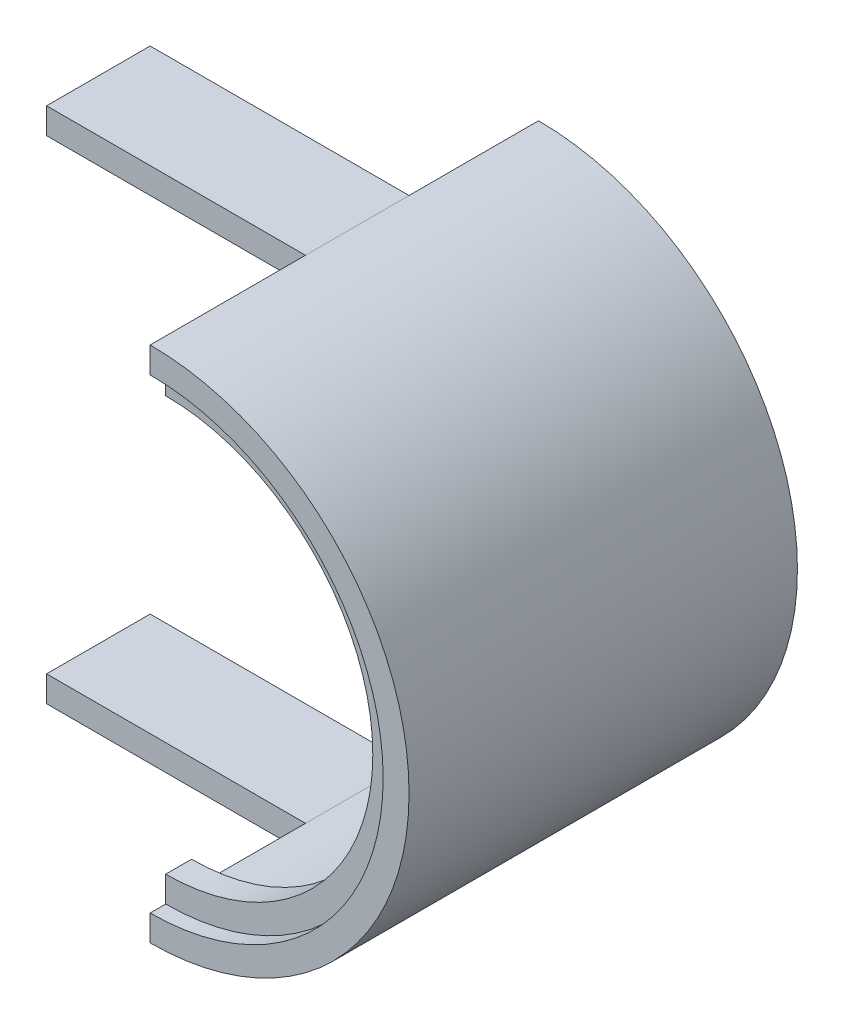
ISO-10303-21;
HEADER;
FILE_DESCRIPTION(('STEP AP214'),'2;1');
FILE_NAME('part.step','',(''),(''),'','','');
FILE_SCHEMA(('AUTOMOTIVE_DESIGN { 1 0 10303 214 1 1 1 1 }'));
ENDSEC;
DATA;
#1=APPLICATION_CONTEXT('core data for automotive mechanical design processes');
#2=APPLICATION_PROTOCOL_DEFINITION('international standard','automotive_design',2000,#1);
#3=PRODUCT_CONTEXT('',#1,'mechanical');
#4=PRODUCT('Part','Part','',(#3));
#5=PRODUCT_RELATED_PRODUCT_CATEGORY('part','',(#4));
#6=PRODUCT_DEFINITION_FORMATION('','',#4);
#7=PRODUCT_DEFINITION_CONTEXT('part definition',#1,'design');
#8=PRODUCT_DEFINITION('design','',#6,#7);
#9=PRODUCT_DEFINITION_SHAPE('','',#8);
#10=(LENGTH_UNIT() NAMED_UNIT(*) SI_UNIT(.MILLI.,.METRE.));
#11=(NAMED_UNIT(*) PLANE_ANGLE_UNIT() SI_UNIT($,.RADIAN.));
#12=(NAMED_UNIT(*) SI_UNIT($,.STERADIAN.) SOLID_ANGLE_UNIT());
#13=UNCERTAINTY_MEASURE_WITH_UNIT(LENGTH_MEASURE(1.E-05),#10,'distance_accuracy_value','');
#14=(GEOMETRIC_REPRESENTATION_CONTEXT(3) GLOBAL_UNCERTAINTY_ASSIGNED_CONTEXT((#13)) GLOBAL_UNIT_ASSIGNED_CONTEXT((#10,
#11,#12)) REPRESENTATION_CONTEXT('',''));
#15=CARTESIAN_POINT('',(0.,0.,0.));
#16=DIRECTION('',(0.,0.,1.));
#17=DIRECTION('',(1.,0.,0.));
#18=AXIS2_PLACEMENT_3D('',#15,#16,#17);
#19=CARTESIAN_POINT('',(597.266258042068,0.,0.));
#20=DIRECTION('',(1.,0.,0.));
#21=DIRECTION('',(0.,0.,-1.));
#22=AXIS2_PLACEMENT_3D('',#19,#20,#21);
#23=PLANE('',#22);
#24=DIRECTION('',(0.,-1.,0.));
#25=VECTOR('',#24,1.);
#26=CARTESIAN_POINT('',(597.266258042068,50.,30.));
#27=LINE('',#26,#25);
#28=CARTESIAN_POINT('',(597.266258042068,50.,30.));
#29=VERTEX_POINT('',#28);
#30=CARTESIAN_POINT('',(597.266258042068,45.,30.));
#31=VERTEX_POINT('',#30);
#32=EDGE_CURVE('E56',#29,#31,#27,.T.);
#33=ORIENTED_EDGE('',*,*,#32,.F.);
#34=DIRECTION('',(0.,0.,-1.));
#35=VECTOR('',#34,1.);
#36=CARTESIAN_POINT('',(597.266258042068,50.,80.));
#37=LINE('',#36,#35);
#38=CARTESIAN_POINT('',(597.266258042068,50.,5.));
#39=VERTEX_POINT('',#38);
#40=EDGE_CURVE('E48',#29,#39,#37,.T.);
#41=ORIENTED_EDGE('',*,*,#40,.T.);
#42=DIRECTION('',(0.,-1.,0.));
#43=VECTOR('',#42,1.);
#44=CARTESIAN_POINT('',(597.266258042068,0.,5.));
#45=LINE('',#44,#43);
#46=CARTESIAN_POINT('',(597.266258042068,45.,5.));
#47=VERTEX_POINT('',#46);
#48=EDGE_CURVE('E220',#39,#47,#45,.T.);
#49=ORIENTED_EDGE('',*,*,#48,.T.);
#50=DIRECTION('',(0.,0.,-1.));
#51=VECTOR('',#50,1.);
#52=CARTESIAN_POINT('',(597.266258042068,45.,80.));
#53=LINE('',#52,#51);
#54=EDGE_CURVE('E233',#31,#47,#53,.T.);
#55=ORIENTED_EDGE('',*,*,#54,.F.);
#56=EDGE_LOOP('',(#33,#41,#49,#55));
#57=FACE_BOUND('',#56,.T.);
#58=ADVANCED_FACE('F39',(#57),#23,.F.);
#59=DIRECTION('',(0.,1.,0.));
#60=VECTOR('',#59,1.);
#61=CARTESIAN_POINT('',(597.266258042068,50.,50.));
#62=LINE('',#61,#60);
#63=CARTESIAN_POINT('',(597.266258042068,45.,50.));
#64=VERTEX_POINT('',#63);
#65=CARTESIAN_POINT('',(597.266258042068,50.,50.));
#66=VERTEX_POINT('',#65);
#67=EDGE_CURVE('E283',#64,#66,#62,.T.);
#68=ORIENTED_EDGE('',*,*,#67,.F.);
#69=CARTESIAN_POINT('',(597.266258042068,45.,72.));
#70=VERTEX_POINT('',#69);
#71=EDGE_CURVE('E229',#70,#64,#53,.T.);
#72=ORIENTED_EDGE('',*,*,#71,.F.);
#73=DIRECTION('',(0.,-1.,0.));
#74=VECTOR('',#73,1.);
#75=CARTESIAN_POINT('',(597.266258042068,0.,72.));
#76=LINE('',#75,#74);
#77=CARTESIAN_POINT('',(597.266258042068,40.,72.));
#78=VERTEX_POINT('',#77);
#79=EDGE_CURVE('E232',#70,#78,#76,.T.);
#80=ORIENTED_EDGE('',*,*,#79,.T.);
#81=DIRECTION('',(0.,0.,1.));
#82=VECTOR('',#81,1.);
#83=CARTESIAN_POINT('',(597.266258042068,40.,4.99000000000001));
#84=LINE('',#83,#82);
#85=CARTESIAN_POINT('',(597.266258042068,40.,77.));
#86=VERTEX_POINT('',#85);
#87=EDGE_CURVE('E242',#86,#78,#84,.F.);
#88=ORIENTED_EDGE('',*,*,#87,.F.);
#89=DIRECTION('',(0.,-1.,0.));
#90=VECTOR('',#89,1.);
#91=CARTESIAN_POINT('',(597.266258042068,0.,77.));
#92=LINE('',#91,#90);
#93=CARTESIAN_POINT('',(597.266258042068,45.,77.));
#94=VERTEX_POINT('',#93);
#95=EDGE_CURVE('E249',#94,#86,#92,.T.);
#96=ORIENTED_EDGE('',*,*,#95,.F.);
#97=DIRECTION('',(0.,0.,-1.));
#98=VECTOR('',#97,1.);
#99=CARTESIAN_POINT('',(597.266258042068,45.,80.));
#100=LINE('',#99,#98);
#101=CARTESIAN_POINT('',(597.266258042068,45.,80.));
#102=VERTEX_POINT('',#101);
#103=EDGE_CURVE('E260',#102,#94,#100,.T.);
#104=ORIENTED_EDGE('',*,*,#103,.F.);
#105=DIRECTION('',(0.,1.,0.));
#106=VECTOR('',#105,1.);
#107=CARTESIAN_POINT('',(597.266258042068,0.,80.));
#108=LINE('',#107,#106);
#109=CARTESIAN_POINT('',(597.266258042068,50.,80.));
#110=VERTEX_POINT('',#109);
#111=EDGE_CURVE('E252',#102,#110,#108,.T.);
#112=ORIENTED_EDGE('',*,*,#111,.T.);
#113=EDGE_CURVE('E12',#110,#66,#37,.T.);
#114=ORIENTED_EDGE('',*,*,#113,.T.);
#115=EDGE_LOOP('',(#68,#72,#80,#88,#96,#104,#112,#114));
#116=FACE_BOUND('',#115,.T.);
#117=ADVANCED_FACE('F287',(#116),#23,.F.);
#118=DIRECTION('',(0.,-1.,0.));
#119=VECTOR('',#118,1.);
#120=CARTESIAN_POINT('',(597.266258042068,-45.,30.));
#121=LINE('',#120,#119);
#122=CARTESIAN_POINT('',(597.266258042068,-45.,30.));
#123=VERTEX_POINT('',#122);
#124=CARTESIAN_POINT('',(597.266258042068,-50.,30.));
#125=VERTEX_POINT('',#124);
#126=EDGE_CURVE('E176',#123,#125,#121,.T.);
#127=ORIENTED_EDGE('',*,*,#126,.F.);
#128=DIRECTION('',(0.,0.,-1.));
#129=VECTOR('',#128,1.);
#130=CARTESIAN_POINT('',(597.266258042068,-45.,80.));
#131=LINE('',#130,#129);
#132=CARTESIAN_POINT('',(597.266258042068,-45.,5.));
#133=VERTEX_POINT('',#132);
#134=EDGE_CURVE('E218',#123,#133,#131,.T.);
#135=ORIENTED_EDGE('',*,*,#134,.T.);
#136=CARTESIAN_POINT('',(597.266258042068,-50.,5.));
#137=VERTEX_POINT('',#136);
#138=EDGE_CURVE('E219',#133,#137,#45,.T.);
#139=ORIENTED_EDGE('',*,*,#138,.T.);
#140=DIRECTION('',(0.,0.,-1.));
#141=VECTOR('',#140,1.);
#142=CARTESIAN_POINT('',(597.266258042068,-50.,80.));
#143=LINE('',#142,#141);
#144=EDGE_CURVE('E64',#125,#137,#143,.T.);
#145=ORIENTED_EDGE('',*,*,#144,.F.);
#146=EDGE_LOOP('',(#127,#135,#139,#145));
#147=FACE_BOUND('',#146,.T.);
#148=ADVANCED_FACE('F41',(#147),#23,.F.);
#149=DIRECTION('',(0.,1.,0.));
#150=VECTOR('',#149,1.);
#151=CARTESIAN_POINT('',(597.266258042068,-45.,50.));
#152=LINE('',#151,#150);
#153=CARTESIAN_POINT('',(597.266258042068,-50.,50.));
#154=VERTEX_POINT('',#153);
#155=CARTESIAN_POINT('',(597.266258042068,-45.,50.));
#156=VERTEX_POINT('',#155);
#157=EDGE_CURVE('E198',#154,#156,#152,.T.);
#158=ORIENTED_EDGE('',*,*,#157,.F.);
#159=CARTESIAN_POINT('',(597.266258042068,-50.,80.));
#160=VERTEX_POINT('',#159);
#161=EDGE_CURVE('E266',#160,#154,#143,.T.);
#162=ORIENTED_EDGE('',*,*,#161,.F.);
#163=CARTESIAN_POINT('',(597.266258042068,-45.,80.));
#164=VERTEX_POINT('',#163);
#165=EDGE_CURVE('E255',#160,#164,#108,.T.);
#166=ORIENTED_EDGE('',*,*,#165,.T.);
#167=DIRECTION('',(0.,0.,-1.));
#168=VECTOR('',#167,1.);
#169=CARTESIAN_POINT('',(597.266258042068,-45.,80.));
#170=LINE('',#169,#168);
#171=CARTESIAN_POINT('',(597.266258042068,-45.,77.));
#172=VERTEX_POINT('',#171);
#173=EDGE_CURVE('E256',#164,#172,#170,.T.);
#174=ORIENTED_EDGE('',*,*,#173,.T.);
#175=CARTESIAN_POINT('',(597.266258042068,-40.,77.));
#176=VERTEX_POINT('',#175);
#177=EDGE_CURVE('E251',#176,#172,#92,.T.);
#178=ORIENTED_EDGE('',*,*,#177,.F.);
#179=DIRECTION('',(0.,0.,1.));
#180=VECTOR('',#179,1.);
#181=CARTESIAN_POINT('',(597.266258042068,-40.,4.99000000000001));
#182=LINE('',#181,#180);
#183=CARTESIAN_POINT('',(597.266258042068,-40.,72.));
#184=VERTEX_POINT('',#183);
#185=EDGE_CURVE('E214',#184,#176,#182,.T.);
#186=ORIENTED_EDGE('',*,*,#185,.F.);
#187=CARTESIAN_POINT('',(597.266258042068,-45.,72.));
#188=VERTEX_POINT('',#187);
#189=EDGE_CURVE('E248',#184,#188,#76,.T.);
#190=ORIENTED_EDGE('',*,*,#189,.T.);
#191=EDGE_CURVE('E234',#188,#156,#131,.T.);
#192=ORIENTED_EDGE('',*,*,#191,.T.);
#193=EDGE_LOOP('',(#158,#162,#166,#174,#178,#186,#190,#192));
#194=FACE_BOUND('',#193,.T.);
#195=ADVANCED_FACE('F297',(#194),#23,.F.);
#196=CARTESIAN_POINT('',(-502.733741957931,0.,80.));
#197=DIRECTION('',(0.,0.,1.));
#198=DIRECTION('',(1.,0.,0.));
#199=AXIS2_PLACEMENT_3D('',#196,#197,#198);
#200=PLANE('',#199);
#201=ORIENTED_EDGE('',*,*,#165,.F.);
#202=CARTESIAN_POINT('',(597.266258042068,0.,80.));
#203=DIRECTION('',(0.,0.,1.));
#204=DIRECTION('',(1.,0.,0.));
#205=AXIS2_PLACEMENT_3D('',#202,#203,#204);
#206=CIRCLE('',#205,50.);
#207=EDGE_CURVE('E257',#160,#110,#206,.T.);
#208=ORIENTED_EDGE('',*,*,#207,.T.);
#209=ORIENTED_EDGE('',*,*,#111,.F.);
#210=CARTESIAN_POINT('',(597.266258042068,0.,80.));
#211=DIRECTION('',(0.,0.,1.));
#212=DIRECTION('',(1.,0.,0.));
#213=AXIS2_PLACEMENT_3D('',#210,#211,#212);
#214=CIRCLE('',#213,45.);
#215=EDGE_CURVE('E261',#164,#102,#214,.T.);
#216=ORIENTED_EDGE('',*,*,#215,.F.);
#217=EDGE_LOOP('',(#201,#208,#209,#216));
#218=FACE_BOUND('',#217,.T.);
#219=ADVANCED_FACE('F294',(#218),#200,.T.);
#220=CARTESIAN_POINT('',(597.266258042068,0.,80.));
#221=DIRECTION('',(0.,0.,-1.));
#222=DIRECTION('',(-1.,0.,0.));
#223=AXIS2_PLACEMENT_3D('',#220,#221,#222);
#224=CYLINDRICAL_SURFACE('',#223,50.);
#225=ORIENTED_EDGE('',*,*,#161,.T.);
#226=DIRECTION('',(0.,0.,1.));
#227=VECTOR('',#226,1.);
#228=CARTESIAN_POINT('',(597.266258042068,-50.,30.));
#229=LINE('',#228,#227);
#230=EDGE_CURVE('E179',#125,#154,#229,.T.);
#231=ORIENTED_EDGE('',*,*,#230,.F.);
#232=ORIENTED_EDGE('',*,*,#144,.T.);
#233=CARTESIAN_POINT('',(597.266258042068,0.,5.));
#234=DIRECTION('',(0.,0.,1.));
#235=DIRECTION('',(1.,0.,0.));
#236=AXIS2_PLACEMENT_3D('',#233,#234,#235);
#237=CIRCLE('',#236,50.);
#238=EDGE_CURVE('E215',#137,#39,#237,.T.);
#239=ORIENTED_EDGE('',*,*,#238,.T.);
#240=ORIENTED_EDGE('',*,*,#40,.F.);
#241=DIRECTION('',(0.,0.,-1.));
#242=VECTOR('',#241,1.);
#243=CARTESIAN_POINT('',(597.266258042068,50.,30.));
#244=LINE('',#243,#242);
#245=EDGE_CURVE('E173',#66,#29,#244,.T.);
#246=ORIENTED_EDGE('',*,*,#245,.F.);
#247=ORIENTED_EDGE('',*,*,#113,.F.);
#248=ORIENTED_EDGE('',*,*,#207,.F.);
#249=EDGE_LOOP('',(#225,#231,#232,#239,#240,#246,#247,#248));
#250=FACE_BOUND('',#249,.T.);
#251=ADVANCED_FACE('F270',(#250),#224,.T.);
#252=CARTESIAN_POINT('',(597.266258042068,0.,80.));
#253=DIRECTION('',(0.,0.,-1.));
#254=DIRECTION('',(-1.,0.,0.));
#255=AXIS2_PLACEMENT_3D('',#252,#253,#254);
#256=CYLINDRICAL_SURFACE('',#255,45.);
#257=CARTESIAN_POINT('',(597.266258042068,0.,77.));
#258=DIRECTION('',(0.,0.,1.));
#259=DIRECTION('',(1.,0.,0.));
#260=AXIS2_PLACEMENT_3D('',#257,#258,#259);
#261=CIRCLE('',#260,45.);
#262=EDGE_CURVE('E43',#172,#94,#261,.T.);
#263=ORIENTED_EDGE('',*,*,#262,.F.);
#264=ORIENTED_EDGE('',*,*,#173,.F.);
#265=ORIENTED_EDGE('',*,*,#215,.T.);
#266=ORIENTED_EDGE('',*,*,#103,.T.);
#267=EDGE_LOOP('',(#263,#264,#265,#266));
#268=FACE_BOUND('',#267,.T.);
#269=ADVANCED_FACE('F345',(#268),#256,.F.);
#270=CARTESIAN_POINT('',(597.266258042068,-45.,77.));
#271=DIRECTION('',(0.,0.,1.));
#272=DIRECTION('',(1.,0.,0.));
#273=AXIS2_PLACEMENT_3D('',#270,#271,#272);
#274=PLANE('',#273);
#275=ORIENTED_EDGE('',*,*,#177,.T.);
#276=ORIENTED_EDGE('',*,*,#262,.T.);
#277=ORIENTED_EDGE('',*,*,#95,.T.);
#278=CARTESIAN_POINT('',(597.266258042068,0.,77.));
#279=DIRECTION('',(0.,0.,1.));
#280=DIRECTION('',(1.,0.,0.));
#281=AXIS2_PLACEMENT_3D('',#278,#279,#280);
#282=CIRCLE('',#281,40.);
#283=EDGE_CURVE('E228',#86,#176,#282,.F.);
#284=ORIENTED_EDGE('',*,*,#283,.T.);
#285=EDGE_LOOP('',(#275,#276,#277,#284));
#286=FACE_BOUND('',#285,.T.);
#287=ADVANCED_FACE('F332',(#286),#274,.T.);
#288=CARTESIAN_POINT('',(597.266258042068,0.,4.99000000000001));
#289=DIRECTION('',(0.,0.,1.));
#290=DIRECTION('',(1.,0.,0.));
#291=AXIS2_PLACEMENT_3D('',#288,#289,#290);
#292=CYLINDRICAL_SURFACE('',#291,40.);
#293=ORIENTED_EDGE('',*,*,#87,.T.);
#294=CARTESIAN_POINT('',(597.266258042068,0.,72.));
#295=DIRECTION('',(0.,0.,1.));
#296=DIRECTION('',(1.,0.,0.));
#297=AXIS2_PLACEMENT_3D('',#294,#295,#296);
#298=CIRCLE('',#297,40.);
#299=EDGE_CURVE('E239',#78,#184,#298,.F.);
#300=ORIENTED_EDGE('',*,*,#299,.T.);
#301=ORIENTED_EDGE('',*,*,#185,.T.);
#302=ORIENTED_EDGE('',*,*,#283,.F.);
#303=EDGE_LOOP('',(#293,#300,#301,#302));
#304=FACE_BOUND('',#303,.T.);
#305=ADVANCED_FACE('F320',(#304),#292,.F.);
#306=CARTESIAN_POINT('',(597.266258042068,-45.,5.));
#307=DIRECTION('',(0.,0.,1.));
#308=DIRECTION('',(1.,0.,0.));
#309=AXIS2_PLACEMENT_3D('',#306,#307,#308);
#310=PLANE('',#309);
#311=ORIENTED_EDGE('',*,*,#238,.F.);
#312=ORIENTED_EDGE('',*,*,#138,.F.);
#313=CARTESIAN_POINT('',(597.266258042068,0.,5.));
#314=DIRECTION('',(0.,0.,1.));
#315=DIRECTION('',(1.,0.,0.));
#316=AXIS2_PLACEMENT_3D('',#313,#314,#315);
#317=CIRCLE('',#316,45.);
#318=EDGE_CURVE('E223',#133,#47,#317,.T.);
#319=ORIENTED_EDGE('',*,*,#318,.T.);
#320=ORIENTED_EDGE('',*,*,#48,.F.);
#321=EDGE_LOOP('',(#311,#312,#319,#320));
#322=FACE_BOUND('',#321,.T.);
#323=ADVANCED_FACE('F277',(#322),#310,.F.);
#324=CARTESIAN_POINT('',(597.266258042068,0.,80.));
#325=DIRECTION('',(0.,0.,-1.));
#326=DIRECTION('',(-1.,0.,0.));
#327=AXIS2_PLACEMENT_3D('',#324,#325,#326);
#328=CYLINDRICAL_SURFACE('',#327,45.);
#329=ORIENTED_EDGE('',*,*,#191,.F.);
#330=CARTESIAN_POINT('',(597.266258042068,0.,72.));
#331=DIRECTION('',(0.,0.,1.));
#332=DIRECTION('',(1.,0.,0.));
#333=AXIS2_PLACEMENT_3D('',#330,#331,#332);
#334=CIRCLE('',#333,45.);
#335=EDGE_CURVE('E226',#188,#70,#334,.T.);
#336=ORIENTED_EDGE('',*,*,#335,.T.);
#337=ORIENTED_EDGE('',*,*,#71,.T.);
#338=DIRECTION('',(0.,0.,1.));
#339=VECTOR('',#338,1.);
#340=CARTESIAN_POINT('',(597.266258042068,45.,30.));
#341=LINE('',#340,#339);
#342=EDGE_CURVE('E545',#31,#64,#341,.T.);
#343=ORIENTED_EDGE('',*,*,#342,.F.);
#344=ORIENTED_EDGE('',*,*,#54,.T.);
#345=ORIENTED_EDGE('',*,*,#318,.F.);
#346=ORIENTED_EDGE('',*,*,#134,.F.);
#347=DIRECTION('',(0.,0.,-1.));
#348=VECTOR('',#347,1.);
#349=CARTESIAN_POINT('',(597.266258042068,-45.,30.));
#350=LINE('',#349,#348);
#351=EDGE_CURVE('E189',#156,#123,#350,.T.);
#352=ORIENTED_EDGE('',*,*,#351,.F.);
#353=EDGE_LOOP('',(#329,#336,#337,#343,#344,#345,#346,#352));
#354=FACE_BOUND('',#353,.T.);
#355=ADVANCED_FACE('F327',(#354),#328,.F.);
#356=CARTESIAN_POINT('',(0.,0.,72.));
#357=DIRECTION('',(0.,0.,1.));
#358=DIRECTION('',(1.,0.,0.));
#359=AXIS2_PLACEMENT_3D('',#356,#357,#358);
#360=PLANE('',#359);
#361=ORIENTED_EDGE('',*,*,#299,.F.);
#362=ORIENTED_EDGE('',*,*,#79,.F.);
#363=ORIENTED_EDGE('',*,*,#335,.F.);
#364=ORIENTED_EDGE('',*,*,#189,.F.);
#365=EDGE_LOOP('',(#361,#362,#363,#364));
#366=FACE_BOUND('',#365,.T.);
#367=ADVANCED_FACE('F318',(#366),#360,.F.);
#368=CARTESIAN_POINT('',(547.266258042068,-45.,30.));
#369=DIRECTION('',(0.,0.,1.));
#370=DIRECTION('',(1.,0.,0.));
#371=AXIS2_PLACEMENT_3D('',#368,#369,#370);
#372=PLANE('',#371);
#373=ORIENTED_EDGE('',*,*,#126,.T.);
#374=DIRECTION('',(1.,0.,0.));
#375=VECTOR('',#374,1.);
#376=CARTESIAN_POINT('',(547.266258042068,-50.,30.));
#377=LINE('',#376,#375);
#378=CARTESIAN_POINT('',(547.266258042068,-50.,30.));
#379=VERTEX_POINT('',#378);
#380=EDGE_CURVE('E211',#379,#125,#377,.T.);
#381=ORIENTED_EDGE('',*,*,#380,.F.);
#382=DIRECTION('',(0.,-1.,0.));
#383=VECTOR('',#382,1.);
#384=CARTESIAN_POINT('',(547.266258042068,-45.,30.));
#385=LINE('',#384,#383);
#386=CARTESIAN_POINT('',(547.266258042068,-45.,30.));
#387=VERTEX_POINT('',#386);
#388=EDGE_CURVE('E185',#387,#379,#385,.T.);
#389=ORIENTED_EDGE('',*,*,#388,.F.);
#390=DIRECTION('',(1.,0.,0.));
#391=VECTOR('',#390,1.);
#392=CARTESIAN_POINT('',(547.266258042068,-45.,30.));
#393=LINE('',#392,#391);
#394=EDGE_CURVE('E194',#387,#123,#393,.T.);
#395=ORIENTED_EDGE('',*,*,#394,.T.);
#396=EDGE_LOOP('',(#373,#381,#389,#395));
#397=FACE_BOUND('',#396,.T.);
#398=ADVANCED_FACE('F316',(#397),#372,.F.);
#399=CARTESIAN_POINT('',(547.266258042068,-50.,30.));
#400=DIRECTION('',(0.,1.,0.));
#401=DIRECTION('',(0.,0.,1.));
#402=AXIS2_PLACEMENT_3D('',#399,#400,#401);
#403=PLANE('',#402);
#404=ORIENTED_EDGE('',*,*,#230,.T.);
#405=DIRECTION('',(1.,0.,0.));
#406=VECTOR('',#405,1.);
#407=CARTESIAN_POINT('',(547.266258042068,-50.,50.));
#408=LINE('',#407,#406);
#409=CARTESIAN_POINT('',(547.266258042068,-50.,50.));
#410=VERTEX_POINT('',#409);
#411=EDGE_CURVE('E208',#410,#154,#408,.T.);
#412=ORIENTED_EDGE('',*,*,#411,.F.);
#413=DIRECTION('',(0.,0.,1.));
#414=VECTOR('',#413,1.);
#415=CARTESIAN_POINT('',(547.266258042068,-50.,30.));
#416=LINE('',#415,#414);
#417=EDGE_CURVE('E188',#379,#410,#416,.T.);
#418=ORIENTED_EDGE('',*,*,#417,.F.);
#419=ORIENTED_EDGE('',*,*,#380,.T.);
#420=EDGE_LOOP('',(#404,#412,#418,#419));
#421=FACE_BOUND('',#420,.T.);
#422=ADVANCED_FACE('F314',(#421),#403,.F.);
#423=CARTESIAN_POINT('',(547.266258042068,-45.,50.));
#424=DIRECTION('',(0.,0.,-1.));
#425=DIRECTION('',(-1.,0.,0.));
#426=AXIS2_PLACEMENT_3D('',#423,#424,#425);
#427=PLANE('',#426);
#428=ORIENTED_EDGE('',*,*,#157,.T.);
#429=DIRECTION('',(1.,0.,0.));
#430=VECTOR('',#429,1.);
#431=CARTESIAN_POINT('',(547.266258042068,-45.,50.));
#432=LINE('',#431,#430);
#433=CARTESIAN_POINT('',(547.266258042068,-45.,50.));
#434=VERTEX_POINT('',#433);
#435=EDGE_CURVE('E205',#434,#156,#432,.T.);
#436=ORIENTED_EDGE('',*,*,#435,.F.);
#437=DIRECTION('',(0.,1.,0.));
#438=VECTOR('',#437,1.);
#439=CARTESIAN_POINT('',(547.266258042068,-45.,50.));
#440=LINE('',#439,#438);
#441=EDGE_CURVE('E191',#410,#434,#440,.T.);
#442=ORIENTED_EDGE('',*,*,#441,.F.);
#443=ORIENTED_EDGE('',*,*,#411,.T.);
#444=EDGE_LOOP('',(#428,#436,#442,#443));
#445=FACE_BOUND('',#444,.T.);
#446=ADVANCED_FACE('F302',(#445),#427,.F.);
#447=CARTESIAN_POINT('',(547.266258042068,-45.,30.));
#448=DIRECTION('',(0.,-1.,0.));
#449=DIRECTION('',(0.,0.,-1.));
#450=AXIS2_PLACEMENT_3D('',#447,#448,#449);
#451=PLANE('',#450);
#452=ORIENTED_EDGE('',*,*,#351,.T.);
#453=ORIENTED_EDGE('',*,*,#394,.F.);
#454=DIRECTION('',(0.,0.,-1.));
#455=VECTOR('',#454,1.);
#456=CARTESIAN_POINT('',(547.266258042068,-45.,30.));
#457=LINE('',#456,#455);
#458=EDGE_CURVE('E193',#434,#387,#457,.T.);
#459=ORIENTED_EDGE('',*,*,#458,.F.);
#460=ORIENTED_EDGE('',*,*,#435,.T.);
#461=EDGE_LOOP('',(#452,#453,#459,#460));
#462=FACE_BOUND('',#461,.T.);
#463=ADVANCED_FACE('F307',(#462),#451,.F.);
#464=CARTESIAN_POINT('',(547.266258042068,0.,0.));
#465=DIRECTION('',(-1.,0.,0.));
#466=DIRECTION('',(0.,0.,1.));
#467=AXIS2_PLACEMENT_3D('',#464,#465,#466);
#468=PLANE('',#467);
#469=ORIENTED_EDGE('',*,*,#388,.T.);
#470=ORIENTED_EDGE('',*,*,#417,.T.);
#471=ORIENTED_EDGE('',*,*,#441,.T.);
#472=ORIENTED_EDGE('',*,*,#458,.T.);
#473=EDGE_LOOP('',(#469,#470,#471,#472));
#474=FACE_BOUND('',#473,.T.);
#475=ADVANCED_FACE('F311',(#474),#468,.T.);
#476=CARTESIAN_POINT('',(547.266258042068,50.,30.));
#477=DIRECTION('',(0.,0.,1.));
#478=DIRECTION('',(1.,0.,0.));
#479=AXIS2_PLACEMENT_3D('',#476,#477,#478);
#480=PLANE('',#479);
#481=ORIENTED_EDGE('',*,*,#32,.T.);
#482=DIRECTION('',(1.,0.,0.));
#483=VECTOR('',#482,1.);
#484=CARTESIAN_POINT('',(547.266258042068,45.,30.));
#485=LINE('',#484,#483);
#486=CARTESIAN_POINT('',(547.266258042068,45.,30.));
#487=VERTEX_POINT('',#486);
#488=EDGE_CURVE('E159',#487,#31,#485,.T.);
#489=ORIENTED_EDGE('',*,*,#488,.F.);
#490=DIRECTION('',(0.,-1.,0.));
#491=VECTOR('',#490,1.);
#492=CARTESIAN_POINT('',(547.266258042068,50.,30.));
#493=LINE('',#492,#491);
#494=CARTESIAN_POINT('',(547.266258042068,50.,30.));
#495=VERTEX_POINT('',#494);
#496=EDGE_CURVE('E166',#495,#487,#493,.T.);
#497=ORIENTED_EDGE('',*,*,#496,.F.);
#498=DIRECTION('',(1.,0.,0.));
#499=VECTOR('',#498,1.);
#500=CARTESIAN_POINT('',(547.266258042068,50.,30.));
#501=LINE('',#500,#499);
#502=EDGE_CURVE('E547',#495,#29,#501,.T.);
#503=ORIENTED_EDGE('',*,*,#502,.T.);
#504=EDGE_LOOP('',(#481,#489,#497,#503));
#505=FACE_BOUND('',#504,.T.);
#506=ADVANCED_FACE('F175',(#505),#480,.F.);
#507=CARTESIAN_POINT('',(547.266258042068,45.,30.));
#508=DIRECTION('',(0.,1.,0.));
#509=DIRECTION('',(0.,0.,1.));
#510=AXIS2_PLACEMENT_3D('',#507,#508,#509);
#511=PLANE('',#510);
#512=ORIENTED_EDGE('',*,*,#342,.T.);
#513=DIRECTION('',(1.,0.,0.));
#514=VECTOR('',#513,1.);
#515=CARTESIAN_POINT('',(547.266258042068,45.,50.));
#516=LINE('',#515,#514);
#517=CARTESIAN_POINT('',(547.266258042068,45.,50.));
#518=VERTEX_POINT('',#517);
#519=EDGE_CURVE('E162',#518,#64,#516,.T.);
#520=ORIENTED_EDGE('',*,*,#519,.F.);
#521=DIRECTION('',(0.,0.,1.));
#522=VECTOR('',#521,1.);
#523=CARTESIAN_POINT('',(547.266258042068,45.,30.));
#524=LINE('',#523,#522);
#525=EDGE_CURVE('E156',#487,#518,#524,.T.);
#526=ORIENTED_EDGE('',*,*,#525,.F.);
#527=ORIENTED_EDGE('',*,*,#488,.T.);
#528=EDGE_LOOP('',(#512,#520,#526,#527));
#529=FACE_BOUND('',#528,.T.);
#530=ADVANCED_FACE('F158',(#529),#511,.F.);
#531=CARTESIAN_POINT('',(547.266258042068,50.,50.));
#532=DIRECTION('',(0.,0.,-1.));
#533=DIRECTION('',(-1.,0.,0.));
#534=AXIS2_PLACEMENT_3D('',#531,#532,#533);
#535=PLANE('',#534);
#536=ORIENTED_EDGE('',*,*,#67,.T.);
#537=DIRECTION('',(1.,0.,0.));
#538=VECTOR('',#537,1.);
#539=CARTESIAN_POINT('',(547.266258042068,50.,50.));
#540=LINE('',#539,#538);
#541=CARTESIAN_POINT('',(547.266258042068,50.,50.));
#542=VERTEX_POINT('',#541);
#543=EDGE_CURVE('E181',#542,#66,#540,.T.);
#544=ORIENTED_EDGE('',*,*,#543,.F.);
#545=DIRECTION('',(0.,1.,0.));
#546=VECTOR('',#545,1.);
#547=CARTESIAN_POINT('',(547.266258042068,50.,50.));
#548=LINE('',#547,#546);
#549=EDGE_CURVE('E165',#518,#542,#548,.T.);
#550=ORIENTED_EDGE('',*,*,#549,.F.);
#551=ORIENTED_EDGE('',*,*,#519,.T.);
#552=EDGE_LOOP('',(#536,#544,#550,#551));
#553=FACE_BOUND('',#552,.T.);
#554=ADVANCED_FACE('F509',(#553),#535,.F.);
#555=CARTESIAN_POINT('',(547.266258042068,50.,30.));
#556=DIRECTION('',(0.,-1.,0.));
#557=DIRECTION('',(0.,0.,-1.));
#558=AXIS2_PLACEMENT_3D('',#555,#556,#557);
#559=PLANE('',#558);
#560=ORIENTED_EDGE('',*,*,#245,.T.);
#561=ORIENTED_EDGE('',*,*,#502,.F.);
#562=DIRECTION('',(0.,0.,-1.));
#563=VECTOR('',#562,1.);
#564=CARTESIAN_POINT('',(547.266258042068,50.,30.));
#565=LINE('',#564,#563);
#566=EDGE_CURVE('E171',#542,#495,#565,.T.);
#567=ORIENTED_EDGE('',*,*,#566,.F.);
#568=ORIENTED_EDGE('',*,*,#543,.T.);
#569=EDGE_LOOP('',(#560,#561,#567,#568));
#570=FACE_BOUND('',#569,.T.);
#571=ADVANCED_FACE('F516',(#570),#559,.F.);
#572=CARTESIAN_POINT('',(547.266258042068,0.,0.));
#573=DIRECTION('',(-1.,0.,0.));
#574=DIRECTION('',(0.,0.,1.));
#575=AXIS2_PLACEMENT_3D('',#572,#573,#574);
#576=PLANE('',#575);
#577=ORIENTED_EDGE('',*,*,#496,.T.);
#578=ORIENTED_EDGE('',*,*,#525,.T.);
#579=ORIENTED_EDGE('',*,*,#549,.T.);
#580=ORIENTED_EDGE('',*,*,#566,.T.);
#581=EDGE_LOOP('',(#577,#578,#579,#580));
#582=FACE_BOUND('',#581,.T.);
#583=ADVANCED_FACE('F169',(#582),#576,.T.);
#584=CLOSED_SHELL('',(#58,#117,#148,#195,#219,#251,#269,#287,#305,#323,#355,#367,#398,#422,#446,
#463,#475,#506,#530,#554,#571,#583));
#585=MANIFOLD_SOLID_BREP('B2',#584);
#586=ADVANCED_BREP_SHAPE_REPRESENTATION('',(#18,#585),#14);
#587=SHAPE_DEFINITION_REPRESENTATION(#9,#586);
ENDSEC;
END-ISO-10303-21;
